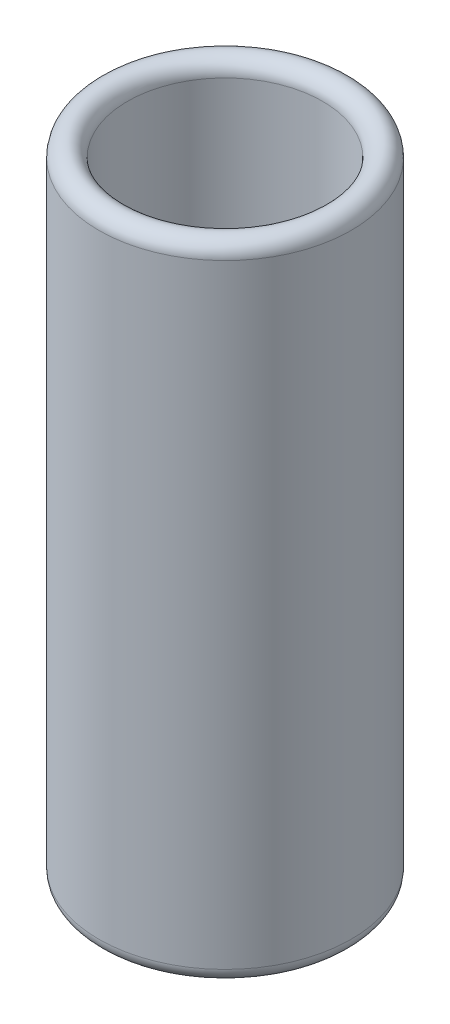
ISO-10303-21;
HEADER;
FILE_DESCRIPTION(('STEP AP214'),'2;1');
FILE_NAME('part.step','',(''),(''),'','','');
FILE_SCHEMA(('AUTOMOTIVE_DESIGN { 1 0 10303 214 1 1 1 1 }'));
ENDSEC;
DATA;
#1=APPLICATION_CONTEXT('core data for automotive mechanical design processes');
#2=APPLICATION_PROTOCOL_DEFINITION('international standard','automotive_design',2000,#1);
#3=PRODUCT_CONTEXT('',#1,'mechanical');
#4=PRODUCT('Part','Part','',(#3));
#5=PRODUCT_RELATED_PRODUCT_CATEGORY('part','',(#4));
#6=PRODUCT_DEFINITION_FORMATION('','',#4);
#7=PRODUCT_DEFINITION_CONTEXT('part definition',#1,'design');
#8=PRODUCT_DEFINITION('design','',#6,#7);
#9=PRODUCT_DEFINITION_SHAPE('','',#8);
#10=(LENGTH_UNIT() NAMED_UNIT(*) SI_UNIT(.MILLI.,.METRE.));
#11=(NAMED_UNIT(*) PLANE_ANGLE_UNIT() SI_UNIT($,.RADIAN.));
#12=(NAMED_UNIT(*) SI_UNIT($,.STERADIAN.) SOLID_ANGLE_UNIT());
#13=UNCERTAINTY_MEASURE_WITH_UNIT(LENGTH_MEASURE(1.E-05),#10,'distance_accuracy_value','');
#14=(GEOMETRIC_REPRESENTATION_CONTEXT(3) GLOBAL_UNCERTAINTY_ASSIGNED_CONTEXT((#13)) GLOBAL_UNIT_ASSIGNED_CONTEXT((#10,
#11,#12)) REPRESENTATION_CONTEXT('',''));
#15=CARTESIAN_POINT('',(0.,0.,0.));
#16=DIRECTION('',(0.,0.,1.));
#17=DIRECTION('',(1.,0.,0.));
#18=AXIS2_PLACEMENT_3D('',#15,#16,#17);
#19=CARTESIAN_POINT('',(0.,21.4,0.));
#20=DIRECTION('',(0.,1.,0.));
#21=DIRECTION('',(0.,0.,1.));
#22=AXIS2_PLACEMENT_3D('',#19,#20,#21);
#23=TOROIDAL_SURFACE('',#22,3.9,0.5);
#24=CARTESIAN_POINT('',(0.,21.4,0.));
#25=DIRECTION('',(0.,1.,0.));
#26=DIRECTION('',(0.,0.,1.));
#27=AXIS2_PLACEMENT_3D('',#24,#25,#26);
#28=CIRCLE('',#27,3.4);
#29=CARTESIAN_POINT('',(0.,21.4,3.4));
#30=VERTEX_POINT('',#29);
#31=EDGE_CURVE('E10',#30,#30,#28,.T.);
#32=ORIENTED_EDGE('',*,*,#31,.F.);
#33=EDGE_LOOP('',(#32));
#34=FACE_BOUND('',#33,.T.);
#35=CARTESIAN_POINT('',(0.,21.4,0.));
#36=DIRECTION('',(0.,1.,0.));
#37=DIRECTION('',(0.,0.,1.));
#38=AXIS2_PLACEMENT_3D('',#35,#36,#37);
#39=CIRCLE('',#38,4.4);
#40=CARTESIAN_POINT('',(0.,21.4,4.4));
#41=VERTEX_POINT('',#40);
#42=EDGE_CURVE('E46',#41,#41,#39,.T.);
#43=ORIENTED_EDGE('',*,*,#42,.T.);
#44=EDGE_LOOP('',(#43));
#45=FACE_BOUND('',#44,.T.);
#46=ADVANCED_FACE('F32',(#34,#45),#23,.T.);
#47=CARTESIAN_POINT('',(0.,23.0309914299784,0.));
#48=DIRECTION('',(0.,1.,0.));
#49=DIRECTION('',(0.,0.,1.));
#50=AXIS2_PLACEMENT_3D('',#47,#48,#49);
#51=CYLINDRICAL_SURFACE('',#50,3.4);
#52=CARTESIAN_POINT('',(0.,0.,0.));
#53=DIRECTION('',(0.,1.,0.));
#54=DIRECTION('',(0.,0.,1.));
#55=AXIS2_PLACEMENT_3D('',#52,#53,#54);
#56=CIRCLE('',#55,3.4);
#57=CARTESIAN_POINT('',(0.,0.,3.4));
#58=VERTEX_POINT('',#57);
#59=EDGE_CURVE('E38',#58,#58,#56,.T.);
#60=ORIENTED_EDGE('',*,*,#59,.F.);
#61=EDGE_LOOP('',(#60));
#62=FACE_BOUND('',#61,.T.);
#63=ORIENTED_EDGE('',*,*,#31,.T.);
#64=EDGE_LOOP('',(#63));
#65=FACE_BOUND('',#64,.T.);
#66=ADVANCED_FACE('F61',(#62,#65),#51,.F.);
#67=CARTESIAN_POINT('',(0.,0.,0.));
#68=DIRECTION('',(0.,1.,0.));
#69=DIRECTION('',(0.,0.,1.));
#70=AXIS2_PLACEMENT_3D('',#67,#68,#69);
#71=TOROIDAL_SURFACE('',#70,3.9,0.5);
#72=CARTESIAN_POINT('',(0.,0.,0.));
#73=DIRECTION('',(0.,1.,0.));
#74=DIRECTION('',(0.,0.,1.));
#75=AXIS2_PLACEMENT_3D('',#72,#73,#74);
#76=CIRCLE('',#75,4.4);
#77=CARTESIAN_POINT('',(0.,0.,4.4));
#78=VERTEX_POINT('',#77);
#79=EDGE_CURVE('E42',#78,#78,#76,.T.);
#80=ORIENTED_EDGE('',*,*,#79,.F.);
#81=EDGE_LOOP('',(#80));
#82=FACE_BOUND('',#81,.T.);
#83=ORIENTED_EDGE('',*,*,#59,.T.);
#84=EDGE_LOOP('',(#83));
#85=FACE_BOUND('',#84,.T.);
#86=ADVANCED_FACE('F56',(#82,#85),#71,.T.);
#87=CARTESIAN_POINT('',(0.,23.0309914299784,0.));
#88=DIRECTION('',(0.,1.,0.));
#89=DIRECTION('',(0.,0.,1.));
#90=AXIS2_PLACEMENT_3D('',#87,#88,#89);
#91=CYLINDRICAL_SURFACE('',#90,4.4);
#92=ORIENTED_EDGE('',*,*,#42,.F.);
#93=EDGE_LOOP('',(#92));
#94=FACE_BOUND('',#93,.T.);
#95=ORIENTED_EDGE('',*,*,#79,.T.);
#96=EDGE_LOOP('',(#95));
#97=FACE_BOUND('',#96,.T.);
#98=ADVANCED_FACE('F53',(#94,#97),#91,.T.);
#99=CLOSED_SHELL('',(#46,#66,#86,#98));
#100=MANIFOLD_SOLID_BREP('B2',#99);
#101=ADVANCED_BREP_SHAPE_REPRESENTATION('',(#18,#100),#14);
#102=SHAPE_DEFINITION_REPRESENTATION(#9,#101);
ENDSEC;
END-ISO-10303-21;
